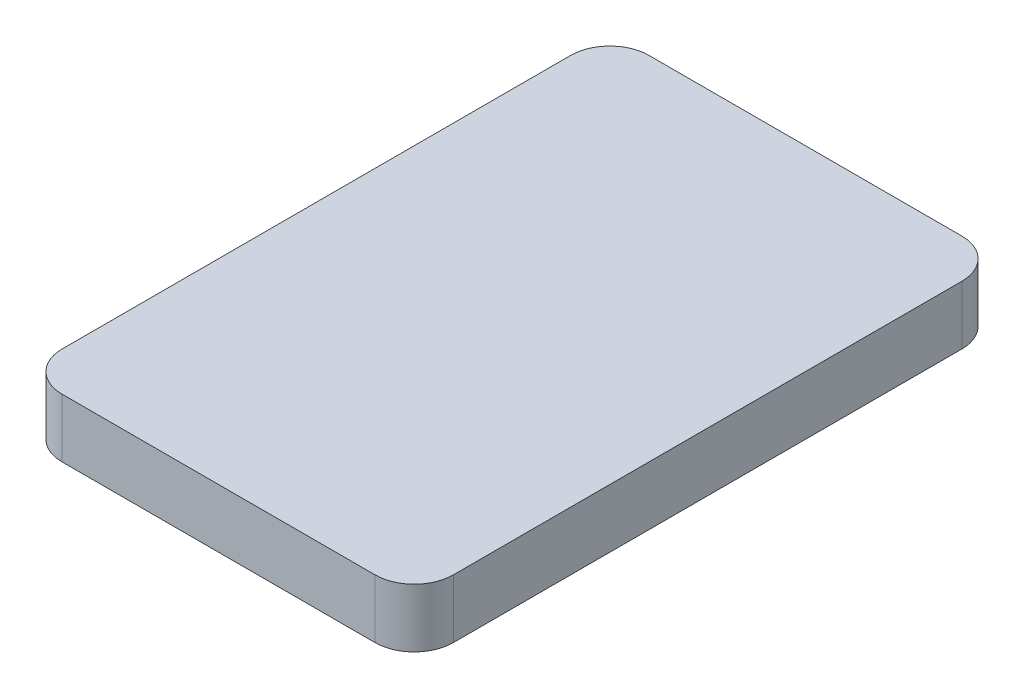
ISO-10303-21;
HEADER;
FILE_DESCRIPTION(('STEP AP214'),'2;1');
FILE_NAME('part.step','',(''),(''),'','','');
FILE_SCHEMA(('AUTOMOTIVE_DESIGN { 1 0 10303 214 1 1 1 1 }'));
ENDSEC;
DATA;
#1=APPLICATION_CONTEXT('core data for automotive mechanical design processes');
#2=APPLICATION_PROTOCOL_DEFINITION('international standard','automotive_design',2000,#1);
#3=PRODUCT_CONTEXT('',#1,'mechanical');
#4=PRODUCT('Part','Part','',(#3));
#5=PRODUCT_RELATED_PRODUCT_CATEGORY('part','',(#4));
#6=PRODUCT_DEFINITION_FORMATION('','',#4);
#7=PRODUCT_DEFINITION_CONTEXT('part definition',#1,'design');
#8=PRODUCT_DEFINITION('design','',#6,#7);
#9=PRODUCT_DEFINITION_SHAPE('','',#8);
#10=(LENGTH_UNIT() NAMED_UNIT(*) SI_UNIT(.MILLI.,.METRE.));
#11=(NAMED_UNIT(*) PLANE_ANGLE_UNIT() SI_UNIT($,.RADIAN.));
#12=(NAMED_UNIT(*) SI_UNIT($,.STERADIAN.) SOLID_ANGLE_UNIT());
#13=UNCERTAINTY_MEASURE_WITH_UNIT(LENGTH_MEASURE(1.E-05),#10,'distance_accuracy_value','');
#14=(GEOMETRIC_REPRESENTATION_CONTEXT(3) GLOBAL_UNCERTAINTY_ASSIGNED_CONTEXT((#13)) GLOBAL_UNIT_ASSIGNED_CONTEXT((#10,
#11,#12)) REPRESENTATION_CONTEXT('',''));
#15=CARTESIAN_POINT('',(0.,0.,0.));
#16=DIRECTION('',(0.,0.,1.));
#17=DIRECTION('',(1.,0.,0.));
#18=AXIS2_PLACEMENT_3D('',#15,#16,#17);
#19=CARTESIAN_POINT('',(-7.99999999999999,3.,13.));
#20=DIRECTION('',(0.,-1.,0.));
#21=DIRECTION('',(0.,0.,-1.));
#22=AXIS2_PLACEMENT_3D('',#19,#20,#21);
#23=CYLINDRICAL_SURFACE('',#22,2.);
#24=CARTESIAN_POINT('',(-7.99999999999999,0.,13.));
#25=DIRECTION('',(0.,1.,0.));
#26=DIRECTION('',(0.,0.,1.));
#27=AXIS2_PLACEMENT_3D('',#24,#25,#26);
#28=CIRCLE('',#27,2.);
#29=CARTESIAN_POINT('',(-9.99999999999999,0.,13.));
#30=VERTEX_POINT('',#29);
#31=CARTESIAN_POINT('',(-7.99999999999998,0.,15.));
#32=VERTEX_POINT('',#31);
#33=EDGE_CURVE('E128',#30,#32,#28,.T.);
#34=ORIENTED_EDGE('',*,*,#33,.T.);
#35=DIRECTION('',(0.,-1.,0.));
#36=VECTOR('',#35,1.);
#37=CARTESIAN_POINT('',(-7.99999999999998,3.,15.));
#38=LINE('',#37,#36);
#39=CARTESIAN_POINT('',(-7.99999999999998,3.,15.));
#40=VERTEX_POINT('',#39);
#41=EDGE_CURVE('E11',#40,#32,#38,.T.);
#42=ORIENTED_EDGE('',*,*,#41,.F.);
#43=CARTESIAN_POINT('',(-7.99999999999999,3.,13.));
#44=DIRECTION('',(0.,1.,0.));
#45=DIRECTION('',(0.,0.,1.));
#46=AXIS2_PLACEMENT_3D('',#43,#44,#45);
#47=CIRCLE('',#46,2.);
#48=CARTESIAN_POINT('',(-9.99999999999999,3.,13.));
#49=VERTEX_POINT('',#48);
#50=EDGE_CURVE('E142',#49,#40,#47,.T.);
#51=ORIENTED_EDGE('',*,*,#50,.F.);
#52=DIRECTION('',(0.,-1.,0.));
#53=VECTOR('',#52,1.);
#54=CARTESIAN_POINT('',(-9.99999999999999,3.,13.));
#55=LINE('',#54,#53);
#56=EDGE_CURVE('E124',#49,#30,#55,.T.);
#57=ORIENTED_EDGE('',*,*,#56,.T.);
#58=EDGE_LOOP('',(#34,#42,#51,#57));
#59=FACE_BOUND('',#58,.T.);
#60=ADVANCED_FACE('F32',(#59),#23,.T.);
#61=CARTESIAN_POINT('',(-7.99999999999998,3.,15.));
#62=DIRECTION('',(0.,0.,-1.));
#63=DIRECTION('',(-1.,0.,0.));
#64=AXIS2_PLACEMENT_3D('',#61,#62,#63);
#65=PLANE('',#64);
#66=DIRECTION('',(1.,0.,0.));
#67=VECTOR('',#66,1.);
#68=CARTESIAN_POINT('',(-7.99999999999998,0.,15.));
#69=LINE('',#68,#67);
#70=CARTESIAN_POINT('',(7.99999999999999,0.,15.));
#71=VERTEX_POINT('',#70);
#72=EDGE_CURVE('E131',#32,#71,#69,.T.);
#73=ORIENTED_EDGE('',*,*,#72,.T.);
#74=DIRECTION('',(0.,-1.,0.));
#75=VECTOR('',#74,1.);
#76=CARTESIAN_POINT('',(7.99999999999999,3.,15.));
#77=LINE('',#76,#75);
#78=CARTESIAN_POINT('',(7.99999999999999,3.,15.));
#79=VERTEX_POINT('',#78);
#80=EDGE_CURVE('E40',#79,#71,#77,.T.);
#81=ORIENTED_EDGE('',*,*,#80,.F.);
#82=DIRECTION('',(1.,0.,0.));
#83=VECTOR('',#82,1.);
#84=CARTESIAN_POINT('',(-7.99999999999998,3.,15.));
#85=LINE('',#84,#83);
#86=EDGE_CURVE('E91',#40,#79,#85,.T.);
#87=ORIENTED_EDGE('',*,*,#86,.F.);
#88=ORIENTED_EDGE('',*,*,#41,.T.);
#89=EDGE_LOOP('',(#73,#81,#87,#88));
#90=FACE_BOUND('',#89,.T.);
#91=ADVANCED_FACE('F177',(#90),#65,.F.);
#92=CARTESIAN_POINT('',(8.,3.,13.));
#93=DIRECTION('',(0.,-1.,0.));
#94=DIRECTION('',(0.,0.,-1.));
#95=AXIS2_PLACEMENT_3D('',#92,#93,#94);
#96=CYLINDRICAL_SURFACE('',#95,2.);
#97=CARTESIAN_POINT('',(8.,0.,13.));
#98=DIRECTION('',(0.,1.,0.));
#99=DIRECTION('',(0.,0.,1.));
#100=AXIS2_PLACEMENT_3D('',#97,#98,#99);
#101=CIRCLE('',#100,2.);
#102=CARTESIAN_POINT('',(10.,0.,13.));
#103=VERTEX_POINT('',#102);
#104=EDGE_CURVE('E133',#71,#103,#101,.T.);
#105=ORIENTED_EDGE('',*,*,#104,.T.);
#106=DIRECTION('',(0.,-1.,0.));
#107=VECTOR('',#106,1.);
#108=CARTESIAN_POINT('',(10.,3.,13.));
#109=LINE('',#108,#107);
#110=CARTESIAN_POINT('',(10.,3.,13.));
#111=VERTEX_POINT('',#110);
#112=EDGE_CURVE('E149',#111,#103,#109,.T.);
#113=ORIENTED_EDGE('',*,*,#112,.F.);
#114=CARTESIAN_POINT('',(8.,3.,13.));
#115=DIRECTION('',(0.,1.,0.));
#116=DIRECTION('',(0.,0.,1.));
#117=AXIS2_PLACEMENT_3D('',#114,#115,#116);
#118=CIRCLE('',#117,2.);
#119=EDGE_CURVE('E157',#79,#111,#118,.T.);
#120=ORIENTED_EDGE('',*,*,#119,.F.);
#121=ORIENTED_EDGE('',*,*,#80,.T.);
#122=EDGE_LOOP('',(#105,#113,#120,#121));
#123=FACE_BOUND('',#122,.T.);
#124=ADVANCED_FACE('F155',(#123),#96,.T.);
#125=CARTESIAN_POINT('',(10.,3.,-13.));
#126=DIRECTION('',(-1.,0.,0.));
#127=DIRECTION('',(0.,0.,1.));
#128=AXIS2_PLACEMENT_3D('',#125,#126,#127);
#129=PLANE('',#128);
#130=DIRECTION('',(0.,0.,-1.));
#131=VECTOR('',#130,1.);
#132=CARTESIAN_POINT('',(10.,0.,-13.));
#133=LINE('',#132,#131);
#134=CARTESIAN_POINT('',(10.,0.,-13.));
#135=VERTEX_POINT('',#134);
#136=EDGE_CURVE('E135',#103,#135,#133,.T.);
#137=ORIENTED_EDGE('',*,*,#136,.T.);
#138=DIRECTION('',(0.,-1.,0.));
#139=VECTOR('',#138,1.);
#140=CARTESIAN_POINT('',(10.,3.,-13.));
#141=LINE('',#140,#139);
#142=CARTESIAN_POINT('',(10.,3.,-13.));
#143=VERTEX_POINT('',#142);
#144=EDGE_CURVE('E146',#143,#135,#141,.T.);
#145=ORIENTED_EDGE('',*,*,#144,.F.);
#146=DIRECTION('',(0.,0.,-1.));
#147=VECTOR('',#146,1.);
#148=CARTESIAN_POINT('',(10.,3.,-13.));
#149=LINE('',#148,#147);
#150=EDGE_CURVE('E169',#111,#143,#149,.T.);
#151=ORIENTED_EDGE('',*,*,#150,.F.);
#152=ORIENTED_EDGE('',*,*,#112,.T.);
#153=EDGE_LOOP('',(#137,#145,#151,#152));
#154=FACE_BOUND('',#153,.T.);
#155=ADVANCED_FACE('F165',(#154),#129,.F.);
#156=CARTESIAN_POINT('',(8.,3.,-13.));
#157=DIRECTION('',(0.,-1.,0.));
#158=DIRECTION('',(0.,0.,-1.));
#159=AXIS2_PLACEMENT_3D('',#156,#157,#158);
#160=CYLINDRICAL_SURFACE('',#159,2.);
#161=CARTESIAN_POINT('',(8.,0.,-13.));
#162=DIRECTION('',(0.,1.,0.));
#163=DIRECTION('',(0.,0.,-1.));
#164=AXIS2_PLACEMENT_3D('',#161,#162,#163);
#165=CIRCLE('',#164,2.);
#166=CARTESIAN_POINT('',(7.99999999999998,0.,-15.));
#167=VERTEX_POINT('',#166);
#168=EDGE_CURVE('E137',#135,#167,#165,.T.);
#169=ORIENTED_EDGE('',*,*,#168,.T.);
#170=DIRECTION('',(0.,-1.,0.));
#171=VECTOR('',#170,1.);
#172=CARTESIAN_POINT('',(7.99999999999998,3.,-15.));
#173=LINE('',#172,#171);
#174=CARTESIAN_POINT('',(7.99999999999998,3.,-15.));
#175=VERTEX_POINT('',#174);
#176=EDGE_CURVE('E119',#175,#167,#173,.T.);
#177=ORIENTED_EDGE('',*,*,#176,.F.);
#178=CARTESIAN_POINT('',(8.,3.,-13.));
#179=DIRECTION('',(0.,1.,0.));
#180=DIRECTION('',(0.,0.,-1.));
#181=AXIS2_PLACEMENT_3D('',#178,#179,#180);
#182=CIRCLE('',#181,2.);
#183=EDGE_CURVE('E110',#143,#175,#182,.T.);
#184=ORIENTED_EDGE('',*,*,#183,.F.);
#185=ORIENTED_EDGE('',*,*,#144,.T.);
#186=EDGE_LOOP('',(#169,#177,#184,#185));
#187=FACE_BOUND('',#186,.T.);
#188=ADVANCED_FACE('F168',(#187),#160,.T.);
#189=CARTESIAN_POINT('',(-7.99999999999999,3.,-15.));
#190=DIRECTION('',(0.,0.,1.));
#191=DIRECTION('',(1.,0.,0.));
#192=AXIS2_PLACEMENT_3D('',#189,#190,#191);
#193=PLANE('',#192);
#194=DIRECTION('',(-1.,0.,0.));
#195=VECTOR('',#194,1.);
#196=CARTESIAN_POINT('',(-7.99999999999999,0.,-15.));
#197=LINE('',#196,#195);
#198=CARTESIAN_POINT('',(-7.99999999999999,0.,-15.));
#199=VERTEX_POINT('',#198);
#200=EDGE_CURVE('E118',#167,#199,#197,.T.);
#201=ORIENTED_EDGE('',*,*,#200,.T.);
#202=DIRECTION('',(0.,-1.,0.));
#203=VECTOR('',#202,1.);
#204=CARTESIAN_POINT('',(-7.99999999999999,3.,-15.));
#205=LINE('',#204,#203);
#206=CARTESIAN_POINT('',(-7.99999999999999,3.,-15.));
#207=VERTEX_POINT('',#206);
#208=EDGE_CURVE('E115',#207,#199,#205,.T.);
#209=ORIENTED_EDGE('',*,*,#208,.F.);
#210=DIRECTION('',(-1.,0.,0.));
#211=VECTOR('',#210,1.);
#212=CARTESIAN_POINT('',(-7.99999999999999,3.,-15.));
#213=LINE('',#212,#211);
#214=EDGE_CURVE('E104',#175,#207,#213,.T.);
#215=ORIENTED_EDGE('',*,*,#214,.F.);
#216=ORIENTED_EDGE('',*,*,#176,.T.);
#217=EDGE_LOOP('',(#201,#209,#215,#216));
#218=FACE_BOUND('',#217,.T.);
#219=ADVANCED_FACE('F116',(#218),#193,.F.);
#220=CARTESIAN_POINT('',(-8.,3.,-13.));
#221=DIRECTION('',(0.,-1.,0.));
#222=DIRECTION('',(0.,0.,-1.));
#223=AXIS2_PLACEMENT_3D('',#220,#221,#222);
#224=CYLINDRICAL_SURFACE('',#223,2.);
#225=CARTESIAN_POINT('',(-8.,0.,-13.));
#226=DIRECTION('',(0.,1.,0.));
#227=DIRECTION('',(0.,0.,1.));
#228=AXIS2_PLACEMENT_3D('',#225,#226,#227);
#229=CIRCLE('',#228,2.);
#230=CARTESIAN_POINT('',(-10.,0.,-13.));
#231=VERTEX_POINT('',#230);
#232=EDGE_CURVE('E77',#199,#231,#229,.T.);
#233=ORIENTED_EDGE('',*,*,#232,.T.);
#234=DIRECTION('',(0.,-1.,0.));
#235=VECTOR('',#234,1.);
#236=CARTESIAN_POINT('',(-10.,3.,-13.));
#237=LINE('',#236,#235);
#238=CARTESIAN_POINT('',(-10.,3.,-13.));
#239=VERTEX_POINT('',#238);
#240=EDGE_CURVE('E120',#239,#231,#237,.T.);
#241=ORIENTED_EDGE('',*,*,#240,.F.);
#242=CARTESIAN_POINT('',(-8.,3.,-13.));
#243=DIRECTION('',(0.,1.,0.));
#244=DIRECTION('',(0.,0.,1.));
#245=AXIS2_PLACEMENT_3D('',#242,#243,#244);
#246=CIRCLE('',#245,2.);
#247=EDGE_CURVE('E108',#207,#239,#246,.T.);
#248=ORIENTED_EDGE('',*,*,#247,.F.);
#249=ORIENTED_EDGE('',*,*,#208,.T.);
#250=EDGE_LOOP('',(#233,#241,#248,#249));
#251=FACE_BOUND('',#250,.T.);
#252=ADVANCED_FACE('F122',(#251),#224,.T.);
#253=CARTESIAN_POINT('',(-10.,3.,-13.));
#254=DIRECTION('',(1.,0.,0.));
#255=DIRECTION('',(0.,0.,-1.));
#256=AXIS2_PLACEMENT_3D('',#253,#254,#255);
#257=PLANE('',#256);
#258=DIRECTION('',(0.,0.,1.));
#259=VECTOR('',#258,1.);
#260=CARTESIAN_POINT('',(-10.,0.,-13.));
#261=LINE('',#260,#259);
#262=EDGE_CURVE('E83',#231,#30,#261,.T.);
#263=ORIENTED_EDGE('',*,*,#262,.T.);
#264=ORIENTED_EDGE('',*,*,#56,.F.);
#265=DIRECTION('',(0.,0.,1.));
#266=VECTOR('',#265,1.);
#267=CARTESIAN_POINT('',(-10.,3.,-13.));
#268=LINE('',#267,#266);
#269=EDGE_CURVE('E48',#239,#49,#268,.T.);
#270=ORIENTED_EDGE('',*,*,#269,.F.);
#271=ORIENTED_EDGE('',*,*,#240,.T.);
#272=EDGE_LOOP('',(#263,#264,#270,#271));
#273=FACE_BOUND('',#272,.T.);
#274=ADVANCED_FACE('F193',(#273),#257,.F.);
#275=CARTESIAN_POINT('',(-7.99999999999999,3.,13.));
#276=DIRECTION('',(0.,1.,0.));
#277=DIRECTION('',(0.,0.,1.));
#278=AXIS2_PLACEMENT_3D('',#275,#276,#277);
#279=PLANE('',#278);
#280=ORIENTED_EDGE('',*,*,#50,.T.);
#281=ORIENTED_EDGE('',*,*,#86,.T.);
#282=ORIENTED_EDGE('',*,*,#119,.T.);
#283=ORIENTED_EDGE('',*,*,#150,.T.);
#284=ORIENTED_EDGE('',*,*,#183,.T.);
#285=ORIENTED_EDGE('',*,*,#214,.T.);
#286=ORIENTED_EDGE('',*,*,#247,.T.);
#287=ORIENTED_EDGE('',*,*,#269,.T.);
#288=EDGE_LOOP('',(#280,#281,#282,#283,#284,#285,#286,#287));
#289=FACE_BOUND('',#288,.T.);
#290=ADVANCED_FACE('F106',(#289),#279,.T.);
#291=CARTESIAN_POINT('',(-7.99999999999999,0.,13.));
#292=DIRECTION('',(0.,1.,0.));
#293=DIRECTION('',(0.,0.,1.));
#294=AXIS2_PLACEMENT_3D('',#291,#292,#293);
#295=PLANE('',#294);
#296=ORIENTED_EDGE('',*,*,#33,.F.);
#297=ORIENTED_EDGE('',*,*,#262,.F.);
#298=ORIENTED_EDGE('',*,*,#232,.F.);
#299=ORIENTED_EDGE('',*,*,#200,.F.);
#300=ORIENTED_EDGE('',*,*,#168,.F.);
#301=ORIENTED_EDGE('',*,*,#136,.F.);
#302=ORIENTED_EDGE('',*,*,#104,.F.);
#303=ORIENTED_EDGE('',*,*,#72,.F.);
#304=EDGE_LOOP('',(#296,#297,#298,#299,#300,#301,#302,#303));
#305=FACE_BOUND('',#304,.T.);
#306=ADVANCED_FACE('F161',(#305),#295,.F.);
#307=CLOSED_SHELL('',(#60,#91,#124,#155,#188,#219,#252,#274,#290,#306));
#308=MANIFOLD_SOLID_BREP('B2',#307);
#309=ADVANCED_BREP_SHAPE_REPRESENTATION('',(#18,#308),#14);
#310=SHAPE_DEFINITION_REPRESENTATION(#9,#309);
ENDSEC;
END-ISO-10303-21;
